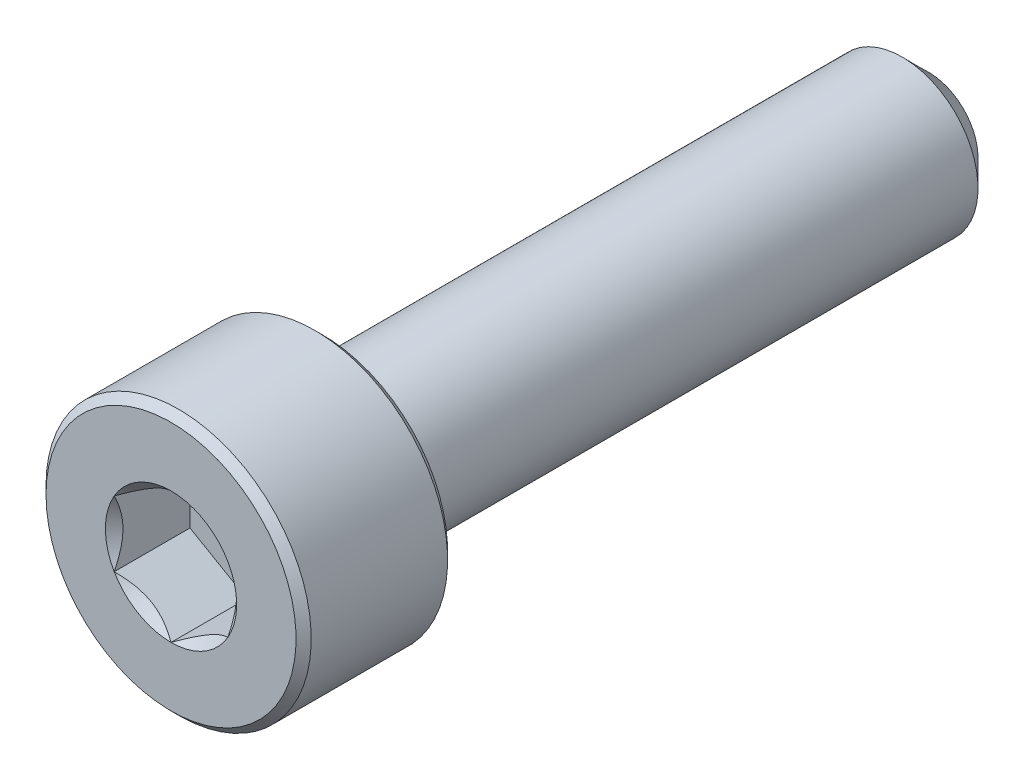
ISO-10303-21;
HEADER;
FILE_DESCRIPTION(('STEP AP214'),'2;1');
FILE_NAME('part.step','',(''),(''),'','','');
FILE_SCHEMA(('AUTOMOTIVE_DESIGN { 1 0 10303 214 1 1 1 1 }'));
ENDSEC;
DATA;
#1=APPLICATION_CONTEXT('core data for automotive mechanical design processes');
#2=APPLICATION_PROTOCOL_DEFINITION('international standard','automotive_design',2000,#1);
#3=PRODUCT_CONTEXT('',#1,'mechanical');
#4=PRODUCT('Part','Part','',(#3));
#5=PRODUCT_RELATED_PRODUCT_CATEGORY('part','',(#4));
#6=PRODUCT_DEFINITION_FORMATION('','',#4);
#7=PRODUCT_DEFINITION_CONTEXT('part definition',#1,'design');
#8=PRODUCT_DEFINITION('design','',#6,#7);
#9=PRODUCT_DEFINITION_SHAPE('','',#8);
#10=(LENGTH_UNIT() NAMED_UNIT(*) SI_UNIT(.MILLI.,.METRE.));
#11=(NAMED_UNIT(*) PLANE_ANGLE_UNIT() SI_UNIT($,.RADIAN.));
#12=(NAMED_UNIT(*) SI_UNIT($,.STERADIAN.) SOLID_ANGLE_UNIT());
#13=UNCERTAINTY_MEASURE_WITH_UNIT(LENGTH_MEASURE(1.E-05),#10,'distance_accuracy_value','');
#14=(GEOMETRIC_REPRESENTATION_CONTEXT(3) GLOBAL_UNCERTAINTY_ASSIGNED_CONTEXT((#13)) GLOBAL_UNIT_ASSIGNED_CONTEXT((#10,
#11,#12)) REPRESENTATION_CONTEXT('',''));
#15=CARTESIAN_POINT('',(0.,0.,0.));
#16=DIRECTION('',(0.,0.,1.));
#17=DIRECTION('',(1.,0.,0.));
#18=AXIS2_PLACEMENT_3D('',#15,#16,#17);
#19=CARTESIAN_POINT('',(0.,3.3,10.));
#20=DIRECTION('',(0.,0.,1.));
#21=DIRECTION('',(1.,0.,0.));
#22=AXIS2_PLACEMENT_3D('',#19,#20,#21);
#23=PLANE('',#22);
#24=CARTESIAN_POINT('',(0.,0.,10.));
#25=DIRECTION('',(0.,0.,1.));
#26=DIRECTION('',(1.,0.,0.));
#27=AXIS2_PLACEMENT_3D('',#24,#25,#26);
#28=CIRCLE('',#27,1.73205080756888);
#29=CARTESIAN_POINT('',(1.5,0.86602540378444,10.));
#30=VERTEX_POINT('',#29);
#31=CARTESIAN_POINT('',(0.,1.73205080756888,10.));
#32=VERTEX_POINT('',#31);
#33=EDGE_CURVE('E92',#30,#32,#28,.T.);
#34=ORIENTED_EDGE('',*,*,#33,.F.);
#35=CARTESIAN_POINT('',(1.5,-0.86602540378444,10.));
#36=VERTEX_POINT('',#35);
#37=EDGE_CURVE('E52',#36,#30,#28,.T.);
#38=ORIENTED_EDGE('',*,*,#37,.F.);
#39=CARTESIAN_POINT('',(0.,-1.73205080756888,10.));
#40=VERTEX_POINT('',#39);
#41=EDGE_CURVE('E278',#40,#36,#28,.T.);
#42=ORIENTED_EDGE('',*,*,#41,.F.);
#43=CARTESIAN_POINT('',(-1.5,-0.866025403784437,10.));
#44=VERTEX_POINT('',#43);
#45=EDGE_CURVE('E59',#44,#40,#28,.T.);
#46=ORIENTED_EDGE('',*,*,#45,.F.);
#47=CARTESIAN_POINT('',(-1.5,0.86602540378444,10.));
#48=VERTEX_POINT('',#47);
#49=EDGE_CURVE('E128',#48,#44,#28,.T.);
#50=ORIENTED_EDGE('',*,*,#49,.F.);
#51=EDGE_CURVE('E101',#32,#48,#28,.T.);
#52=ORIENTED_EDGE('',*,*,#51,.F.);
#53=EDGE_LOOP('',(#34,#38,#42,#46,#50,#52));
#54=FACE_BOUND('',#53,.T.);
#55=CARTESIAN_POINT('',(0.,0.,10.));
#56=DIRECTION('',(0.,0.,-1.));
#57=DIRECTION('',(-1.,0.,0.));
#58=AXIS2_PLACEMENT_3D('',#55,#56,#57);
#59=CIRCLE('',#58,3.3);
#60=CARTESIAN_POINT('',(-3.3,0.,10.));
#61=VERTEX_POINT('',#60);
#62=EDGE_CURVE('E46',#61,#61,#59,.T.);
#63=ORIENTED_EDGE('',*,*,#62,.F.);
#64=EDGE_LOOP('',(#63));
#65=FACE_BOUND('',#64,.T.);
#66=ADVANCED_FACE('F33',(#54,#65),#23,.T.);
#67=CARTESIAN_POINT('',(0.,0.,9.8));
#68=DIRECTION('',(0.,0.,-1.));
#69=DIRECTION('',(-1.,0.,0.));
#70=AXIS2_PLACEMENT_3D('',#67,#68,#69);
#71=CONICAL_SURFACE('',#70,3.5,0.785398163397442);
#72=ORIENTED_EDGE('',*,*,#62,.T.);
#73=EDGE_LOOP('',(#72));
#74=FACE_BOUND('',#73,.T.);
#75=CARTESIAN_POINT('',(0.,0.,9.8));
#76=DIRECTION('',(0.,0.,-1.));
#77=DIRECTION('',(-1.,0.,0.));
#78=AXIS2_PLACEMENT_3D('',#75,#76,#77);
#79=CIRCLE('',#78,3.5);
#80=CARTESIAN_POINT('',(-3.5,0.,9.8));
#81=VERTEX_POINT('',#80);
#82=EDGE_CURVE('E212',#81,#81,#79,.T.);
#83=ORIENTED_EDGE('',*,*,#82,.F.);
#84=EDGE_LOOP('',(#83));
#85=FACE_BOUND('',#84,.T.);
#86=ADVANCED_FACE('F217',(#74,#85),#71,.T.);
#87=CARTESIAN_POINT('',(0.,0.,-10.));
#88=DIRECTION('',(0.,0.,-1.));
#89=DIRECTION('',(-1.,0.,0.));
#90=AXIS2_PLACEMENT_3D('',#87,#88,#89);
#91=CYLINDRICAL_SURFACE('',#90,3.5);
#92=ORIENTED_EDGE('',*,*,#82,.T.);
#93=EDGE_LOOP('',(#92));
#94=FACE_BOUND('',#93,.T.);
#95=CARTESIAN_POINT('',(0.,0.,6.2));
#96=DIRECTION('',(0.,0.,-1.));
#97=DIRECTION('',(-1.,0.,0.));
#98=AXIS2_PLACEMENT_3D('',#95,#96,#97);
#99=CIRCLE('',#98,3.5);
#100=CARTESIAN_POINT('',(-3.5,0.,6.2));
#101=VERTEX_POINT('',#100);
#102=EDGE_CURVE('E209',#101,#101,#99,.T.);
#103=ORIENTED_EDGE('',*,*,#102,.F.);
#104=EDGE_LOOP('',(#103));
#105=FACE_BOUND('',#104,.T.);
#106=ADVANCED_FACE('F223',(#94,#105),#91,.T.);
#107=CARTESIAN_POINT('',(0.,0.,6.));
#108=DIRECTION('',(0.,0.,1.));
#109=DIRECTION('',(1.,0.,0.));
#110=AXIS2_PLACEMENT_3D('',#107,#108,#109);
#111=CONICAL_SURFACE('',#110,3.3,0.785398163397452);
#112=ORIENTED_EDGE('',*,*,#102,.T.);
#113=EDGE_LOOP('',(#112));
#114=FACE_BOUND('',#113,.T.);
#115=CARTESIAN_POINT('',(0.,0.,6.));
#116=DIRECTION('',(0.,0.,-1.));
#117=DIRECTION('',(-1.,0.,0.));
#118=AXIS2_PLACEMENT_3D('',#115,#116,#117);
#119=CIRCLE('',#118,3.3);
#120=CARTESIAN_POINT('',(-3.3,0.,6.));
#121=VERTEX_POINT('',#120);
#122=EDGE_CURVE('E206',#121,#121,#119,.T.);
#123=ORIENTED_EDGE('',*,*,#122,.F.);
#124=EDGE_LOOP('',(#123));
#125=FACE_BOUND('',#124,.T.);
#126=ADVANCED_FACE('F227',(#114,#125),#111,.T.);
#127=CARTESIAN_POINT('',(0.,3.3,6.));
#128=DIRECTION('',(0.,0.,-1.));
#129=DIRECTION('',(-1.,0.,0.));
#130=AXIS2_PLACEMENT_3D('',#127,#128,#129);
#131=PLANE('',#130);
#132=ORIENTED_EDGE('',*,*,#122,.T.);
#133=EDGE_LOOP('',(#132));
#134=FACE_BOUND('',#133,.T.);
#135=CARTESIAN_POINT('',(0.,0.,6.));
#136=DIRECTION('',(0.,0.,-1.));
#137=DIRECTION('',(-1.,0.,0.));
#138=AXIS2_PLACEMENT_3D('',#135,#136,#137);
#139=CIRCLE('',#138,2.);
#140=CARTESIAN_POINT('',(-2.,0.,6.));
#141=VERTEX_POINT('',#140);
#142=EDGE_CURVE('E203',#141,#141,#139,.T.);
#143=ORIENTED_EDGE('',*,*,#142,.F.);
#144=EDGE_LOOP('',(#143));
#145=FACE_BOUND('',#144,.T.);
#146=ADVANCED_FACE('F233',(#134,#145),#131,.T.);
#147=CARTESIAN_POINT('',(0.,0.,-10.));
#148=DIRECTION('',(0.,0.,-1.));
#149=DIRECTION('',(-1.,0.,0.));
#150=AXIS2_PLACEMENT_3D('',#147,#148,#149);
#151=CYLINDRICAL_SURFACE('',#150,2.);
#152=ORIENTED_EDGE('',*,*,#142,.T.);
#153=EDGE_LOOP('',(#152));
#154=FACE_BOUND('',#153,.T.);
#155=CARTESIAN_POINT('',(0.,0.,-9.29999999999999));
#156=DIRECTION('',(0.,0.,-1.));
#157=DIRECTION('',(-1.,0.,0.));
#158=AXIS2_PLACEMENT_3D('',#155,#156,#157);
#159=CIRCLE('',#158,2.);
#160=CARTESIAN_POINT('',(-2.,0.,-9.29999999999999));
#161=VERTEX_POINT('',#160);
#162=EDGE_CURVE('E200',#161,#161,#159,.T.);
#163=ORIENTED_EDGE('',*,*,#162,.F.);
#164=EDGE_LOOP('',(#163));
#165=FACE_BOUND('',#164,.T.);
#166=ADVANCED_FACE('F237',(#154,#165),#151,.T.);
#167=CARTESIAN_POINT('',(0.,0.,-10.));
#168=DIRECTION('',(0.,0.,1.));
#169=DIRECTION('',(1.,0.,0.));
#170=AXIS2_PLACEMENT_3D('',#167,#168,#169);
#171=CONICAL_SURFACE('',#170,1.3,0.785398163397443);
#172=ORIENTED_EDGE('',*,*,#162,.T.);
#173=EDGE_LOOP('',(#172));
#174=FACE_BOUND('',#173,.T.);
#175=CARTESIAN_POINT('',(0.,0.,-10.));
#176=DIRECTION('',(0.,0.,-1.));
#177=DIRECTION('',(-1.,0.,0.));
#178=AXIS2_PLACEMENT_3D('',#175,#176,#177);
#179=CIRCLE('',#178,1.3);
#180=CARTESIAN_POINT('',(-1.3,0.,-10.));
#181=VERTEX_POINT('',#180);
#182=EDGE_CURVE('E188',#181,#181,#179,.T.);
#183=ORIENTED_EDGE('',*,*,#182,.F.);
#184=EDGE_LOOP('',(#183));
#185=FACE_BOUND('',#184,.T.);
#186=ADVANCED_FACE('F240',(#174,#185),#171,.T.);
#187=CARTESIAN_POINT('',(0.,1.3,-10.));
#188=DIRECTION('',(0.,0.,-1.));
#189=DIRECTION('',(-1.,0.,0.));
#190=AXIS2_PLACEMENT_3D('',#187,#188,#189);
#191=PLANE('',#190);
#192=ORIENTED_EDGE('',*,*,#182,.T.);
#193=EDGE_LOOP('',(#192));
#194=FACE_BOUND('',#193,.T.);
#195=ADVANCED_FACE('F161',(#194),#191,.T.);
#196=CARTESIAN_POINT('',(0.,0.,10.));
#197=DIRECTION('',(0.,0.,1.));
#198=DIRECTION('',(1.,0.,0.));
#199=AXIS2_PLACEMENT_3D('',#196,#197,#198);
#200=CONICAL_SURFACE('',#199,1.73205080756888,0.78539816339745);
#201=ORIENTED_EDGE('',*,*,#51,.T.);
#202=CARTESIAN_POINT('',(0.000200000000000415,1.73216627762272,10.0001154816001));
#203=CARTESIAN_POINT('',(-0.0513677907370748,1.70239359975915,9.97036547606733));
#204=CARTESIAN_POINT('',(-0.1037979176652,1.67212305186355,9.94236248391031));
#205=CARTESIAN_POINT('',(-0.210709034055596,1.61039789003619,9.89108923044014));
#206=CARTESIAN_POINT('',(-0.26520019581466,1.57893740312614,9.86784750504438));
#207=CARTESIAN_POINT('',(-0.375079081357248,1.51549879897987,9.82803372899222));
#208=CARTESIAN_POINT('',(-0.430438809095199,1.4835368452681,9.8113615856709));
#209=CARTESIAN_POINT('',(-0.54237725747715,1.41890915196211,9.7856744568181));
#210=CARTESIAN_POINT('',(-0.598952556553008,1.38624538781118,9.77664029047887));
#211=CARTESIAN_POINT('',(-0.69645538951644,1.329952100953,9.76848908122685));
#212=CARTESIAN_POINT('',(-0.737256908280465,1.30639533311124,9.76728225298922));
#213=CARTESIAN_POINT('',(-0.818787969615858,1.25932335290194,9.76931405716227));
#214=CARTESIAN_POINT('',(-0.859517494314629,1.23580815085313,9.77255367074831));
#215=CARTESIAN_POINT('',(-0.940584402163415,1.18900414978427,9.78329198598196));
#216=CARTESIAN_POINT('',(-0.980921384598287,1.1657155821172,9.79079465301873));
#217=CARTESIAN_POINT('',(-1.06091833691403,1.11952932016335,9.80965161192829));
#218=CARTESIAN_POINT('',(-1.10057800851621,1.09663179808786,9.82100755701859));
#219=CARTESIAN_POINT('',(-1.20216313477448,1.03798159809698,9.85472164759267));
#220=CARTESIAN_POINT('',(-1.26345855370969,1.00259267147465,9.87962184909337));
#221=CARTESIAN_POINT('',(-1.35358562846331,0.950557780604375,9.92165665327158));
#222=CARTESIAN_POINT('',(-1.38328513990772,0.933410759677148,9.9364251535591));
#223=CARTESIAN_POINT('',(-1.44213790138375,0.899432101996407,9.96731056594017));
#224=CARTESIAN_POINT('',(-1.47129140422064,0.88260031928571,9.98342683412171));
#225=CARTESIAN_POINT('',(-1.5002,0.865909933730601,10.0001154816001));
#226=B_SPLINE_CURVE_WITH_KNOTS('',3,(#202,#203,#204,#205,#206,#207,#208,#209,#210,#211,#212,
#213,#214,#215,#216,#217,#218,#219,#220,#221,#222,#223,#224,#225),.UNSPECIFIED.,.F.,.F.,(4,2,2,
2,2,2,2,2,2,2,2,4),(0.,0.199829143693304,0.400822987382388,0.59862372053818,0.795926240188889,
0.937113067959881,1.07833105577193,1.21968061668222,1.36109089931054,1.58570969637566,
1.69770705470964,1.80965120737194),.UNSPECIFIED.);
#227=EDGE_CURVE('E11',#32,#48,#226,.T.);
#228=ORIENTED_EDGE('',*,*,#227,.F.);
#229=EDGE_LOOP('',(#201,#228));
#230=FACE_BOUND('',#229,.T.);
#231=ADVANCED_FACE('F105',(#230),#200,.F.);
#232=ORIENTED_EDGE('',*,*,#49,.T.);
#233=CARTESIAN_POINT('',(-1.5,-1.70094076570699,10.5358115093375));
#234=CARTESIAN_POINT('',(-1.5,-1.65940339844307,10.5046624535631));
#235=CARTESIAN_POINT('',(-1.5,-1.61763176138548,10.4738266460381));
#236=CARTESIAN_POINT('',(-1.5,-1.53352581710889,10.4129100581704));
#237=CARTESIAN_POINT('',(-1.5,-1.49119136858461,10.3828294731344));
#238=CARTESIAN_POINT('',(-1.5,-1.36258344501966,10.2934848296331));
#239=CARTESIAN_POINT('',(-1.5,-1.27533705988673,10.2355978134878));
#240=CARTESIAN_POINT('',(-1.5,-1.09255216894207,10.1221956742968));
#241=CARTESIAN_POINT('',(-1.5,-0.996821581803491,10.0669865475731));
#242=CARTESIAN_POINT('',(-1.5,-0.80061308229159,9.9661637894456));
#243=CARTESIAN_POINT('',(-1.5,-0.700152604862087,9.92051785177961));
#244=CARTESIAN_POINT('',(-1.5,-0.549105960820993,9.86468252969872));
#245=CARTESIAN_POINT('',(-1.5,-0.50070074362804,9.84861439232622));
#246=CARTESIAN_POINT('',(-1.5,-0.40274469507941,9.82036772251469));
#247=CARTESIAN_POINT('',(-1.5,-0.353193782853662,9.80818946555124));
#248=CARTESIAN_POINT('',(-1.5,-0.254057869430009,9.78855091399037));
#249=CARTESIAN_POINT('',(-1.5,-0.204488814603775,9.78101136158588));
#250=CARTESIAN_POINT('',(-1.5,-0.104849462627796,9.77079321692886));
#251=CARTESIAN_POINT('',(-1.5,-0.0547792475757581,9.76811384119743));
#252=CARTESIAN_POINT('',(-1.5,0.0436737229088438,9.76780462686182));
#253=CARTESIAN_POINT('',(-1.5,0.0920560164094801,9.77000633072589));
#254=CARTESIAN_POINT('',(-1.5,0.188397733218518,9.77897258823616));
#255=CARTESIAN_POINT('',(-1.5,0.236357072029981,9.78573803359405));
#256=CARTESIAN_POINT('',(-1.5,0.332310053939587,9.80358163901288));
#257=CARTESIAN_POINT('',(-1.5,0.380290051019947,9.81473209678684));
#258=CARTESIAN_POINT('',(-1.5,0.475204866701383,9.84076106187732));
#259=CARTESIAN_POINT('',(-1.5,0.522139781196709,9.85563922560085));
#260=CARTESIAN_POINT('',(-1.5,0.671135849237719,9.90843439268167));
#261=CARTESIAN_POINT('',(-1.5,0.771043708402957,9.95241449643641));
#262=CARTESIAN_POINT('',(-1.5,0.966154320771709,10.0501619481606));
#263=CARTESIAN_POINT('',(-1.5,1.06133841027247,10.1039647104964));
#264=CARTESIAN_POINT('',(-1.5,1.24322962123133,10.2149242663435));
#265=CARTESIAN_POINT('',(-1.5,1.33012275327054,10.2717798884629));
#266=CARTESIAN_POINT('',(-1.5,1.45814294533514,10.3596557398234));
#267=CARTESIAN_POINT('',(-1.5,1.50026316125082,10.3892542436258));
#268=CARTESIAN_POINT('',(-1.5,1.58392901779071,10.4492295725282));
#269=CARTESIAN_POINT('',(-1.5,1.62547481197907,10.4796061831648));
#270=CARTESIAN_POINT('',(-1.5,1.66678158585385,10.5103052870204));
#271=B_SPLINE_CURVE_WITH_KNOTS('',3,(#233,#234,#235,#236,#237,#238,#239,#240,#241,#242,#243,
#244,#245,#246,#247,#248,#249,#250,#251,#252,#253,#254,#255,#256,#257,#258,#259,#260,#261,#262,
#263,#264,#265,#266,#267,#268,#269,#270),.UNSPECIFIED.,.F.,.F.,(4,2,2,2,2,2,2,2,2,2,2,2,2,2,2,2,
2,2,4),(0.,0.155753948201002,0.311547769199354,0.625513832410583,0.95676361465448,
1.28687565594417,1.43975300144579,1.59264117109685,1.74283872260253,1.89301205954152,
2.03808349452257,2.1831832832956,2.33078307442231,2.47836926586908,2.80488410158813,
3.13260026706957,3.44396956433299,3.59840353500356,3.75279538879849),.UNSPECIFIED.);
#272=EDGE_CURVE('E100',#48,#44,#271,.F.);
#273=ORIENTED_EDGE('',*,*,#272,.F.);
#274=EDGE_LOOP('',(#232,#273));
#275=FACE_BOUND('',#274,.T.);
#276=ADVANCED_FACE('F255',(#275),#200,.F.);
#277=ORIENTED_EDGE('',*,*,#45,.T.);
#278=CARTESIAN_POINT('',(-1.5002,-0.865909933730601,10.0001154816001));
#279=CARTESIAN_POINT('',(-1.44863220926292,-0.895682611594166,9.97036547606733));
#280=CARTESIAN_POINT('',(-1.3962020823348,-0.925953159489765,9.94236248391031));
#281=CARTESIAN_POINT('',(-1.2892909659444,-0.987678321317123,9.89108923044014));
#282=CARTESIAN_POINT('',(-1.23479980418534,-1.01913880822717,9.86784750504438));
#283=CARTESIAN_POINT('',(-1.12492091864275,-1.08257741237344,9.82803372899222));
#284=CARTESIAN_POINT('',(-1.0695611909048,-1.11453936608521,9.8113615856709));
#285=CARTESIAN_POINT('',(-0.957622742522851,-1.1791670593912,9.7856744568181));
#286=CARTESIAN_POINT('',(-0.901047443446993,-1.21183082354213,9.77664029047887));
#287=CARTESIAN_POINT('',(-0.803544610483561,-1.26812411040032,9.76848908122685));
#288=CARTESIAN_POINT('',(-0.762743091719535,-1.29168087824208,9.76728225298922));
#289=CARTESIAN_POINT('',(-0.681212030384143,-1.33875285845138,9.76931405716227));
#290=CARTESIAN_POINT('',(-0.640482505685372,-1.36226806050018,9.77255367074831));
#291=CARTESIAN_POINT('',(-0.559415597836586,-1.40907206156905,9.78329198598196));
#292=CARTESIAN_POINT('',(-0.519078615401714,-1.43236062923612,9.79079465301873));
#293=CARTESIAN_POINT('',(-0.439081663085971,-1.47854689118996,9.80965161192829));
#294=CARTESIAN_POINT('',(-0.399421991483794,-1.50144441326545,9.82100755701859));
#295=CARTESIAN_POINT('',(-0.297836865225516,-1.56009461325633,9.85472164759267));
#296=CARTESIAN_POINT('',(-0.236541446290312,-1.59548353987866,9.87962184909337));
#297=CARTESIAN_POINT('',(-0.146414371536687,-1.64751843074894,9.92165665327158));
#298=CARTESIAN_POINT('',(-0.116714860092283,-1.66466545167617,9.9364251535591));
#299=CARTESIAN_POINT('',(-0.0578620986162496,-1.69864410935691,9.96731056594017));
#300=CARTESIAN_POINT('',(-0.0287085957793634,-1.71547589206761,9.98342683412171));
#301=CARTESIAN_POINT('',(0.000199999999999558,-1.73216627762272,10.0001154816001));
#302=B_SPLINE_CURVE_WITH_KNOTS('',3,(#278,#279,#280,#281,#282,#283,#284,#285,#286,#287,#288,
#289,#290,#291,#292,#293,#294,#295,#296,#297,#298,#299,#300,#301),.UNSPECIFIED.,.F.,.F.,(4,2,2,
2,2,2,2,2,2,2,2,4),(0.,0.199829143693304,0.400822987382388,0.59862372053818,0.795926240188888,
0.93711306795988,1.07833105577193,1.21968061668222,1.36109089931054,1.58570969637565,
1.69770705470964,1.80965120737194),.UNSPECIFIED.);
#303=EDGE_CURVE('E137',#44,#40,#302,.T.);
#304=ORIENTED_EDGE('',*,*,#303,.F.);
#305=EDGE_LOOP('',(#277,#304));
#306=FACE_BOUND('',#305,.T.);
#307=ADVANCED_FACE('F259',(#306),#200,.F.);
#308=ORIENTED_EDGE('',*,*,#41,.T.);
#309=CARTESIAN_POINT('',(-0.000200000000000533,-1.73216627762272,10.0001154816001));
#310=CARTESIAN_POINT('',(0.0513677907370749,-1.70239359975915,9.97036547606733));
#311=CARTESIAN_POINT('',(0.1037979176652,-1.67212305186355,9.94236248391031));
#312=CARTESIAN_POINT('',(0.210709034055596,-1.61039789003619,9.89108923044014));
#313=CARTESIAN_POINT('',(0.26520019581466,-1.57893740312614,9.86784750504438));
#314=CARTESIAN_POINT('',(0.375079081357248,-1.51549879897987,9.82803372899222));
#315=CARTESIAN_POINT('',(0.430438809095199,-1.4835368452681,9.8113615856709));
#316=CARTESIAN_POINT('',(0.54237725747715,-1.41890915196211,9.7856744568181));
#317=CARTESIAN_POINT('',(0.598952556553008,-1.38624538781118,9.77664029047887));
#318=CARTESIAN_POINT('',(0.69645538951644,-1.329952100953,9.76848908122685));
#319=CARTESIAN_POINT('',(0.737256908280465,-1.30639533311124,9.76728225298922));
#320=CARTESIAN_POINT('',(0.818787969615857,-1.25932335290194,9.76931405716227));
#321=CARTESIAN_POINT('',(0.859517494314629,-1.23580815085313,9.77255367074831));
#322=CARTESIAN_POINT('',(0.940584402163415,-1.18900414978427,9.78329198598196));
#323=CARTESIAN_POINT('',(0.980921384598287,-1.1657155821172,9.79079465301873));
#324=CARTESIAN_POINT('',(1.06091833691403,-1.11952932016335,9.80965161192829));
#325=CARTESIAN_POINT('',(1.10057800851621,-1.09663179808786,9.82100755701859));
#326=CARTESIAN_POINT('',(1.20216313477448,-1.03798159809698,9.85472164759267));
#327=CARTESIAN_POINT('',(1.26345855370969,-1.00259267147465,9.87962184909337));
#328=CARTESIAN_POINT('',(1.35358562846331,-0.950557780604376,9.92165665327158));
#329=CARTESIAN_POINT('',(1.38328513990772,-0.933410759677149,9.9364251535591));
#330=CARTESIAN_POINT('',(1.44213790138375,-0.899432101996408,9.96731056594017));
#331=CARTESIAN_POINT('',(1.47129140422064,-0.882600319285711,9.98342683412171));
#332=CARTESIAN_POINT('',(1.5002,-0.865909933730602,10.0001154816001));
#333=B_SPLINE_CURVE_WITH_KNOTS('',3,(#309,#310,#311,#312,#313,#314,#315,#316,#317,#318,#319,
#320,#321,#322,#323,#324,#325,#326,#327,#328,#329,#330,#331,#332),.UNSPECIFIED.,.F.,.F.,(4,2,2,
2,2,2,2,2,2,2,2,4),(0.,0.199829143693304,0.400822987382388,0.59862372053818,0.795926240188889,
0.93711306795988,1.07833105577193,1.21968061668222,1.36109089931054,1.58570969637565,
1.69770705470963,1.80965120737194),.UNSPECIFIED.);
#334=EDGE_CURVE('E280',#40,#36,#333,.T.);
#335=ORIENTED_EDGE('',*,*,#334,.F.);
#336=EDGE_LOOP('',(#308,#335));
#337=FACE_BOUND('',#336,.T.);
#338=ADVANCED_FACE('F268',(#337),#200,.F.);
#339=ORIENTED_EDGE('',*,*,#37,.T.);
#340=CARTESIAN_POINT('',(1.5,-1.70094076506827,10.5358115088584));
#341=CARTESIAN_POINT('',(1.5,-1.65940339782208,10.5046624531024));
#342=CARTESIAN_POINT('',(1.5,-1.61763176078228,10.4738266455959));
#343=CARTESIAN_POINT('',(1.5,-1.53352581654145,10.4129100577648));
#344=CARTESIAN_POINT('',(1.5,-1.49119136803515,10.382829472747));
#345=CARTESIAN_POINT('',(1.5,-1.36258344452521,10.293484829301));
#346=CARTESIAN_POINT('',(1.5,-1.2753370594297,10.2355978131923));
#347=CARTESIAN_POINT('',(1.5,-1.09255216856664,10.1221956740766));
#348=CARTESIAN_POINT('',(1.5,-0.996821581472455,10.0669865473912));
#349=CARTESIAN_POINT('',(1.5,-0.800613082053126,9.96616378933479));
#350=CARTESIAN_POINT('',(1.5,-0.70015260467177,9.92051785170157));
#351=CARTESIAN_POINT('',(1.5,-0.549105960667007,9.86468252964533));
#352=CARTESIAN_POINT('',(1.5,-0.500700743459034,9.8486143922722));
#353=CARTESIAN_POINT('',(1.5,-0.402744694879906,9.82036772246244));
#354=CARTESIAN_POINT('',(1.5,-0.35319378263868,9.80818946550141));
#355=CARTESIAN_POINT('',(1.5,-0.254057869184596,9.78855091394885));
#356=CARTESIAN_POINT('',(1.5,-0.204488814343417,9.78101136155019));
#357=CARTESIAN_POINT('',(1.5,-0.104849462338083,9.77079321690814));
#358=CARTESIAN_POINT('',(1.5,-0.0547792472716361,9.76811384118586));
#359=CARTESIAN_POINT('',(1.5,0.0436737232403028,9.76780462687103));
#360=CARTESIAN_POINT('',(1.5,0.0920560167539032,9.77000633074664));
#361=CARTESIAN_POINT('',(1.5,0.188397733587633,9.77897258828183));
#362=CARTESIAN_POINT('',(1.5,0.236357072410824,9.78573803365309));
#363=CARTESIAN_POINT('',(1.5,0.332310054343575,9.80358163910001));
#364=CARTESIAN_POINT('',(1.5,0.380290051435318,9.81473209688875));
#365=CARTESIAN_POINT('',(1.5,0.475204867138458,9.84076106200917));
#366=CARTESIAN_POINT('',(1.5,0.522139781644104,9.85563922574786));
#367=CARTESIAN_POINT('',(1.5,0.671135849783408,9.9084343929006));
#368=CARTESIAN_POINT('',(1.5,0.771043709031689,9.9524144967216));
#369=CARTESIAN_POINT('',(1.5,0.96615432156016,10.0501619485856));
#370=CARTESIAN_POINT('',(1.5,1.06133841113756,10.103964710995));
#371=CARTESIAN_POINT('',(1.5,1.24322962223427,10.214924266983));
#372=CARTESIAN_POINT('',(1.5,1.33012275433518,10.2717798891689));
#373=CARTESIAN_POINT('',(1.5,1.45814294649102,10.359655740629));
#374=CARTESIAN_POINT('',(1.5,1.50026316243668,10.3892542444644));
#375=CARTESIAN_POINT('',(1.5,1.58392901903632,10.4492295734326));
#376=CARTESIAN_POINT('',(1.5,1.62547481325447,10.4796061841021));
#377=CARTESIAN_POINT('',(1.5,1.66678158715899,10.5103052879905));
#378=B_SPLINE_CURVE_WITH_KNOTS('',3,(#340,#341,#342,#343,#344,#345,#346,#347,#348,#349,#350,
#351,#352,#353,#354,#355,#356,#357,#358,#359,#360,#361,#362,#363,#364,#365,#366,#367,#368,#369,
#370,#371,#372,#373,#374,#375,#376,#377),.UNSPECIFIED.,.F.,.F.,(4,2,2,2,2,2,2,2,2,2,2,2,2,2,2,2,
2,2,4),(0.,0.155753948125309,0.311547769047943,0.625513832104915,0.95676361417602,
1.28687565529455,1.43975300083937,1.59264117053357,1.74283872208071,1.89301205906115,
2.03808349408246,2.18318328289586,2.33078307406584,2.47836926555587,2.80488410158167,
3.13260026737189,3.44396956489968,3.59840353570064,3.75279538962595),.UNSPECIFIED.);
#379=EDGE_CURVE('E117',#36,#30,#378,.T.);
#380=ORIENTED_EDGE('',*,*,#379,.F.);
#381=EDGE_LOOP('',(#339,#380));
#382=FACE_BOUND('',#381,.T.);
#383=ADVANCED_FACE('F262',(#382),#200,.F.);
#384=ORIENTED_EDGE('',*,*,#33,.T.);
#385=CARTESIAN_POINT('',(1.5002,0.865909933730602,10.0001154816001));
#386=CARTESIAN_POINT('',(1.44863220926292,0.895682611594167,9.97036547606733));
#387=CARTESIAN_POINT('',(1.3962020823348,0.925953159489766,9.94236248391031));
#388=CARTESIAN_POINT('',(1.2892909659444,0.987678321317125,9.89108923044014));
#389=CARTESIAN_POINT('',(1.23479980418534,1.01913880822718,9.86784750504437));
#390=CARTESIAN_POINT('',(1.12492091864275,1.08257741237344,9.82803372899222));
#391=CARTESIAN_POINT('',(1.0695611909048,1.11453936608522,9.8113615856709));
#392=CARTESIAN_POINT('',(0.957622742522848,1.1791670593912,9.78567445681811));
#393=CARTESIAN_POINT('',(0.90104744344699,1.21183082354213,9.77664029047887));
#394=CARTESIAN_POINT('',(0.803544610483558,1.26812411040032,9.76848908122685));
#395=CARTESIAN_POINT('',(0.762743091719533,1.29168087824208,9.76728225298922));
#396=CARTESIAN_POINT('',(0.681212030384141,1.33875285845138,9.76931405716227));
#397=CARTESIAN_POINT('',(0.640482505685369,1.36226806050018,9.77255367074831));
#398=CARTESIAN_POINT('',(0.559415597836583,1.40907206156905,9.78329198598196));
#399=CARTESIAN_POINT('',(0.51907861540171,1.43236062923612,9.79079465301873));
#400=CARTESIAN_POINT('',(0.439081663085968,1.47854689118997,9.80965161192829));
#401=CARTESIAN_POINT('',(0.399421991483791,1.50144441326545,9.82100755701859));
#402=CARTESIAN_POINT('',(0.297836865225514,1.56009461325633,9.85472164759267));
#403=CARTESIAN_POINT('',(0.23654144629031,1.59548353987866,9.87962184909337));
#404=CARTESIAN_POINT('',(0.146414371536686,1.64751843074894,9.92165665327158));
#405=CARTESIAN_POINT('',(0.116714860092281,1.66466545167617,9.9364251535591));
#406=CARTESIAN_POINT('',(0.0578620986162485,1.69864410935691,9.96731056594017));
#407=CARTESIAN_POINT('',(0.0287085957793627,1.71547589206761,9.98342683412171));
#408=CARTESIAN_POINT('',(-0.000199999999999666,1.73216627762272,10.0001154816001));
#409=B_SPLINE_CURVE_WITH_KNOTS('',3,(#385,#386,#387,#388,#389,#390,#391,#392,#393,#394,#395,
#396,#397,#398,#399,#400,#401,#402,#403,#404,#405,#406,#407,#408),.UNSPECIFIED.,.F.,.F.,(4,2,2,
2,2,2,2,2,2,2,2,4),(0.,0.199829143693305,0.400822987382389,0.598623720538181,0.795926240188889,
0.937113067959881,1.07833105577193,1.21968061668222,1.36109089931055,1.58570969637565,
1.69770705470964,1.80965120737194),.UNSPECIFIED.);
#410=EDGE_CURVE('E96',#30,#32,#409,.T.);
#411=ORIENTED_EDGE('',*,*,#410,.F.);
#412=EDGE_LOOP('',(#384,#411));
#413=FACE_BOUND('',#412,.T.);
#414=ADVANCED_FACE('F94',(#413),#200,.F.);
#415=CARTESIAN_POINT('',(0.,0.,8.));
#416=DIRECTION('',(0.,0.,1.));
#417=DIRECTION('',(1.,0.,0.));
#418=AXIS2_PLACEMENT_3D('',#415,#416,#417);
#419=PLANE('',#418);
#420=DIRECTION('',(-0.866025403784439,0.5,0.));
#421=VECTOR('',#420,1.);
#422=CARTESIAN_POINT('',(1.5,0.86602540378444,8.));
#423=LINE('',#422,#421);
#424=CARTESIAN_POINT('',(1.5,0.86602540378444,8.));
#425=VERTEX_POINT('',#424);
#426=CARTESIAN_POINT('',(0.,1.73205080756888,8.));
#427=VERTEX_POINT('',#426);
#428=EDGE_CURVE('E116',#425,#427,#423,.T.);
#429=ORIENTED_EDGE('',*,*,#428,.T.);
#430=DIRECTION('',(-0.866025403784439,-0.5,0.));
#431=VECTOR('',#430,1.);
#432=CARTESIAN_POINT('',(0.,1.73205080756888,8.));
#433=LINE('',#432,#431);
#434=CARTESIAN_POINT('',(-1.5,0.866025403784439,8.));
#435=VERTEX_POINT('',#434);
#436=EDGE_CURVE('E121',#427,#435,#433,.T.);
#437=ORIENTED_EDGE('',*,*,#436,.T.);
#438=DIRECTION('',(0.,-1.,0.));
#439=VECTOR('',#438,1.);
#440=CARTESIAN_POINT('',(-1.5,0.866025403784439,8.));
#441=LINE('',#440,#439);
#442=CARTESIAN_POINT('',(-1.5,-0.866025403784439,8.));
#443=VERTEX_POINT('',#442);
#444=EDGE_CURVE('E176',#435,#443,#441,.T.);
#445=ORIENTED_EDGE('',*,*,#444,.T.);
#446=DIRECTION('',(0.866025403784439,-0.5,0.));
#447=VECTOR('',#446,1.);
#448=CARTESIAN_POINT('',(-1.5,-0.866025403784439,8.));
#449=LINE('',#448,#447);
#450=CARTESIAN_POINT('',(0.,-1.73205080756888,8.));
#451=VERTEX_POINT('',#450);
#452=EDGE_CURVE('E179',#443,#451,#449,.T.);
#453=ORIENTED_EDGE('',*,*,#452,.T.);
#454=DIRECTION('',(0.866025403784439,0.5,0.));
#455=VECTOR('',#454,1.);
#456=CARTESIAN_POINT('',(0.,-1.73205080756888,8.));
#457=LINE('',#456,#455);
#458=CARTESIAN_POINT('',(1.5,-0.86602540378444,8.));
#459=VERTEX_POINT('',#458);
#460=EDGE_CURVE('E182',#451,#459,#457,.T.);
#461=ORIENTED_EDGE('',*,*,#460,.T.);
#462=DIRECTION('',(0.,1.,0.));
#463=VECTOR('',#462,1.);
#464=CARTESIAN_POINT('',(1.5,-0.86602540378444,8.));
#465=LINE('',#464,#463);
#466=EDGE_CURVE('E124',#459,#425,#465,.T.);
#467=ORIENTED_EDGE('',*,*,#466,.T.);
#468=EDGE_LOOP('',(#429,#437,#445,#453,#461,#467));
#469=FACE_BOUND('',#468,.T.);
#470=ADVANCED_FACE('F156',(#469),#419,.T.);
#471=CARTESIAN_POINT('',(0.,1.73205080756888,8.));
#472=DIRECTION('',(-0.5,0.866025403784439,0.));
#473=DIRECTION('',(-0.866025403784439,-0.5,0.));
#474=AXIS2_PLACEMENT_3D('',#471,#472,#473);
#475=PLANE('',#474);
#476=DIRECTION('',(0.,0.,1.));
#477=VECTOR('',#476,1.);
#478=CARTESIAN_POINT('',(0.,1.73205080756888,8.));
#479=LINE('',#478,#477);
#480=EDGE_CURVE('E113',#427,#32,#479,.T.);
#481=ORIENTED_EDGE('',*,*,#480,.T.);
#482=ORIENTED_EDGE('',*,*,#227,.T.);
#483=DIRECTION('',(0.,0.,1.));
#484=VECTOR('',#483,1.);
#485=CARTESIAN_POINT('',(-1.5,0.866025403784439,8.));
#486=LINE('',#485,#484);
#487=EDGE_CURVE('E123',#435,#48,#486,.T.);
#488=ORIENTED_EDGE('',*,*,#487,.F.);
#489=ORIENTED_EDGE('',*,*,#436,.F.);
#490=EDGE_LOOP('',(#481,#482,#488,#489));
#491=FACE_BOUND('',#490,.T.);
#492=ADVANCED_FACE('F119',(#491),#475,.F.);
#493=CARTESIAN_POINT('',(-1.5,0.866025403784439,8.));
#494=DIRECTION('',(-1.,0.,0.));
#495=DIRECTION('',(0.,-1.,0.));
#496=AXIS2_PLACEMENT_3D('',#493,#494,#495);
#497=PLANE('',#496);
#498=ORIENTED_EDGE('',*,*,#487,.T.);
#499=ORIENTED_EDGE('',*,*,#272,.T.);
#500=DIRECTION('',(0.,0.,1.));
#501=VECTOR('',#500,1.);
#502=CARTESIAN_POINT('',(-1.5,-0.866025403784439,8.));
#503=LINE('',#502,#501);
#504=EDGE_CURVE('E194',#443,#44,#503,.T.);
#505=ORIENTED_EDGE('',*,*,#504,.F.);
#506=ORIENTED_EDGE('',*,*,#444,.F.);
#507=EDGE_LOOP('',(#498,#499,#505,#506));
#508=FACE_BOUND('',#507,.T.);
#509=ADVANCED_FACE('F146',(#508),#497,.F.);
#510=CARTESIAN_POINT('',(-1.5,-0.866025403784439,8.));
#511=DIRECTION('',(-0.5,-0.866025403784439,0.));
#512=DIRECTION('',(0.866025403784439,-0.5,0.));
#513=AXIS2_PLACEMENT_3D('',#510,#511,#512);
#514=PLANE('',#513);
#515=ORIENTED_EDGE('',*,*,#504,.T.);
#516=ORIENTED_EDGE('',*,*,#303,.T.);
#517=DIRECTION('',(0.,0.,1.));
#518=VECTOR('',#517,1.);
#519=CARTESIAN_POINT('',(0.,-1.73205080756888,8.));
#520=LINE('',#519,#518);
#521=EDGE_CURVE('E191',#451,#40,#520,.T.);
#522=ORIENTED_EDGE('',*,*,#521,.F.);
#523=ORIENTED_EDGE('',*,*,#452,.F.);
#524=EDGE_LOOP('',(#515,#516,#522,#523));
#525=FACE_BOUND('',#524,.T.);
#526=ADVANCED_FACE('F149',(#525),#514,.F.);
#527=CARTESIAN_POINT('',(0.,-1.73205080756888,8.));
#528=DIRECTION('',(0.5,-0.866025403784439,0.));
#529=DIRECTION('',(0.866025403784439,0.5,0.));
#530=AXIS2_PLACEMENT_3D('',#527,#528,#529);
#531=PLANE('',#530);
#532=ORIENTED_EDGE('',*,*,#521,.T.);
#533=ORIENTED_EDGE('',*,*,#334,.T.);
#534=DIRECTION('',(0.,0.,1.));
#535=VECTOR('',#534,1.);
#536=CARTESIAN_POINT('',(1.5,-0.86602540378444,8.));
#537=LINE('',#536,#535);
#538=EDGE_CURVE('E189',#459,#36,#537,.T.);
#539=ORIENTED_EDGE('',*,*,#538,.F.);
#540=ORIENTED_EDGE('',*,*,#460,.F.);
#541=EDGE_LOOP('',(#532,#533,#539,#540));
#542=FACE_BOUND('',#541,.T.);
#543=ADVANCED_FACE('F286',(#542),#531,.F.);
#544=CARTESIAN_POINT('',(1.5,-0.86602540378444,8.));
#545=DIRECTION('',(1.,0.,0.));
#546=DIRECTION('',(0.,0.,-1.));
#547=AXIS2_PLACEMENT_3D('',#544,#545,#546);
#548=PLANE('',#547);
#549=ORIENTED_EDGE('',*,*,#538,.T.);
#550=ORIENTED_EDGE('',*,*,#379,.T.);
#551=DIRECTION('',(0.,0.,1.));
#552=VECTOR('',#551,1.);
#553=CARTESIAN_POINT('',(1.5,0.86602540378444,8.));
#554=LINE('',#553,#552);
#555=EDGE_CURVE('E115',#425,#30,#554,.T.);
#556=ORIENTED_EDGE('',*,*,#555,.F.);
#557=ORIENTED_EDGE('',*,*,#466,.F.);
#558=EDGE_LOOP('',(#549,#550,#556,#557));
#559=FACE_BOUND('',#558,.T.);
#560=ADVANCED_FACE('F160',(#559),#548,.F.);
#561=CARTESIAN_POINT('',(1.5,0.86602540378444,8.));
#562=DIRECTION('',(0.5,0.866025403784439,0.));
#563=DIRECTION('',(-0.866025403784439,0.5,0.));
#564=AXIS2_PLACEMENT_3D('',#561,#562,#563);
#565=PLANE('',#564);
#566=ORIENTED_EDGE('',*,*,#555,.T.);
#567=ORIENTED_EDGE('',*,*,#410,.T.);
#568=ORIENTED_EDGE('',*,*,#480,.F.);
#569=ORIENTED_EDGE('',*,*,#428,.F.);
#570=EDGE_LOOP('',(#566,#567,#568,#569));
#571=FACE_BOUND('',#570,.T.);
#572=ADVANCED_FACE('F111',(#571),#565,.F.);
#573=CLOSED_SHELL('',(#66,#86,#106,#126,#146,#166,#186,#195,#231,#276,#307,#338,#383,#414,#470,
#492,#509,#526,#543,#560,#572));
#574=MANIFOLD_SOLID_BREP('B2',#573);
#575=ADVANCED_BREP_SHAPE_REPRESENTATION('',(#18,#574),#14);
#576=SHAPE_DEFINITION_REPRESENTATION(#9,#575);
ENDSEC;
END-ISO-10303-21;
